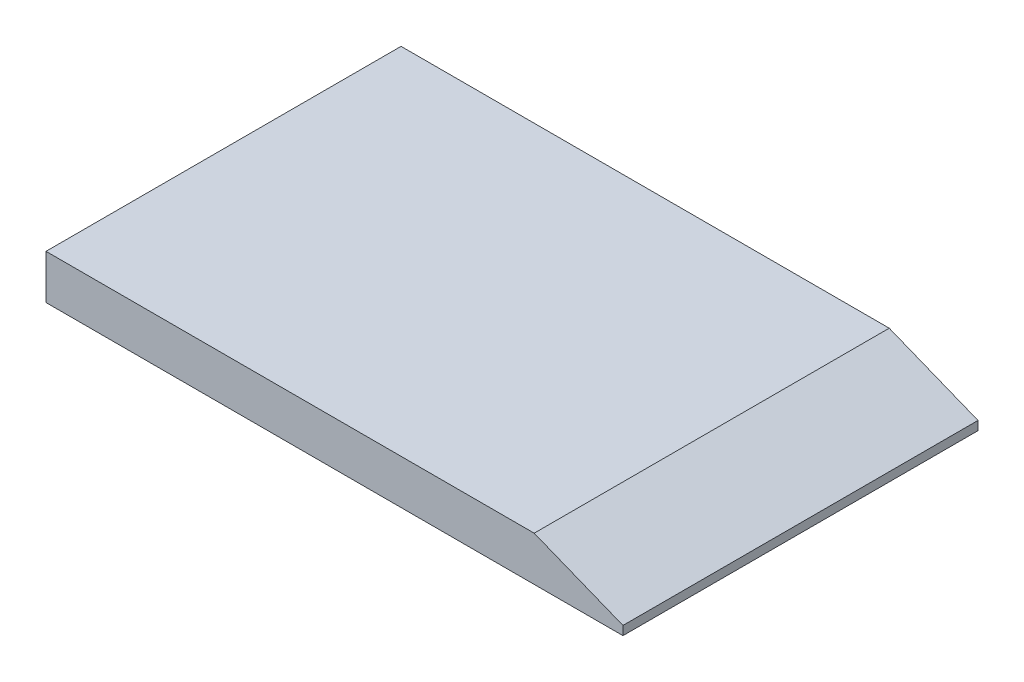
ISO-10303-21;
HEADER;
FILE_DESCRIPTION(('STEP AP214'),'2;1');
FILE_NAME('part.step','',(''),(''),'','','');
FILE_SCHEMA(('AUTOMOTIVE_DESIGN { 1 0 10303 214 1 1 1 1 }'));
ENDSEC;
DATA;
#1=APPLICATION_CONTEXT('core data for automotive mechanical design processes');
#2=APPLICATION_PROTOCOL_DEFINITION('international standard','automotive_design',2000,#1);
#3=PRODUCT_CONTEXT('',#1,'mechanical');
#4=PRODUCT('Part','Part','',(#3));
#5=PRODUCT_RELATED_PRODUCT_CATEGORY('part','',(#4));
#6=PRODUCT_DEFINITION_FORMATION('','',#4);
#7=PRODUCT_DEFINITION_CONTEXT('part definition',#1,'design');
#8=PRODUCT_DEFINITION('design','',#6,#7);
#9=PRODUCT_DEFINITION_SHAPE('','',#8);
#10=(LENGTH_UNIT() NAMED_UNIT(*) SI_UNIT(.MILLI.,.METRE.));
#11=(NAMED_UNIT(*) PLANE_ANGLE_UNIT() SI_UNIT($,.RADIAN.));
#12=(NAMED_UNIT(*) SI_UNIT($,.STERADIAN.) SOLID_ANGLE_UNIT());
#13=UNCERTAINTY_MEASURE_WITH_UNIT(LENGTH_MEASURE(1.E-05),#10,'distance_accuracy_value','');
#14=(GEOMETRIC_REPRESENTATION_CONTEXT(3) GLOBAL_UNCERTAINTY_ASSIGNED_CONTEXT((#13)) GLOBAL_UNIT_ASSIGNED_CONTEXT((#10,
#11,#12)) REPRESENTATION_CONTEXT('',''));
#15=CARTESIAN_POINT('',(0.,0.,0.));
#16=DIRECTION('',(0.,0.,1.));
#17=DIRECTION('',(1.,0.,0.));
#18=AXIS2_PLACEMENT_3D('',#15,#16,#17);
#19=CARTESIAN_POINT('',(65.,10.,40.));
#20=DIRECTION('',(-1.,0.,0.));
#21=DIRECTION('',(0.,0.,1.));
#22=AXIS2_PLACEMENT_3D('',#19,#20,#21);
#23=PLANE('',#22);
#24=DIRECTION('',(0.,-1.,0.));
#25=VECTOR('',#24,1.);
#26=CARTESIAN_POINT('',(65.,10.,-40.));
#27=LINE('',#26,#25);
#28=CARTESIAN_POINT('',(65.,2.,-40.));
#29=VERTEX_POINT('',#28);
#30=CARTESIAN_POINT('',(65.,0.,-40.));
#31=VERTEX_POINT('',#30);
#32=EDGE_CURVE('E11',#29,#31,#27,.T.);
#33=ORIENTED_EDGE('',*,*,#32,.F.);
#34=DIRECTION('',(0.,0.,1.));
#35=VECTOR('',#34,1.);
#36=CARTESIAN_POINT('',(65.,2.,-40.));
#37=LINE('',#36,#35);
#38=CARTESIAN_POINT('',(65.,2.,40.));
#39=VERTEX_POINT('',#38);
#40=EDGE_CURVE('E81',#29,#39,#37,.T.);
#41=ORIENTED_EDGE('',*,*,#40,.T.);
#42=DIRECTION('',(0.,-1.,0.));
#43=VECTOR('',#42,1.);
#44=CARTESIAN_POINT('',(65.,10.,40.));
#45=LINE('',#44,#43);
#46=CARTESIAN_POINT('',(65.,0.,40.));
#47=VERTEX_POINT('',#46);
#48=EDGE_CURVE('E75',#39,#47,#45,.T.);
#49=ORIENTED_EDGE('',*,*,#48,.T.);
#50=DIRECTION('',(0.,0.,-1.));
#51=VECTOR('',#50,1.);
#52=CARTESIAN_POINT('',(65.,0.,40.));
#53=LINE('',#52,#51);
#54=EDGE_CURVE('E79',#47,#31,#53,.T.);
#55=ORIENTED_EDGE('',*,*,#54,.T.);
#56=EDGE_LOOP('',(#33,#41,#49,#55));
#57=FACE_BOUND('',#56,.T.);
#58=ADVANCED_FACE('F33',(#57),#23,.F.);
#59=CARTESIAN_POINT('',(-65.,10.,-40.));
#60=DIRECTION('',(0.,0.,1.));
#61=DIRECTION('',(1.,0.,0.));
#62=AXIS2_PLACEMENT_3D('',#59,#60,#61);
#63=PLANE('',#62);
#64=DIRECTION('',(-1.,0.,0.));
#65=VECTOR('',#64,1.);
#66=CARTESIAN_POINT('',(-65.,10.,-40.));
#67=LINE('',#66,#65);
#68=CARTESIAN_POINT('',(45.,10.,-40.));
#69=VERTEX_POINT('',#68);
#70=CARTESIAN_POINT('',(-65.,10.,-40.));
#71=VERTEX_POINT('',#70);
#72=EDGE_CURVE('E94',#69,#71,#67,.T.);
#73=ORIENTED_EDGE('',*,*,#72,.F.);
#74=DIRECTION('',(0.928476690885259,-0.371390676354104,0.));
#75=VECTOR('',#74,1.);
#76=CARTESIAN_POINT('',(65.,2.,-40.));
#77=LINE('',#76,#75);
#78=EDGE_CURVE('E47',#69,#29,#77,.T.);
#79=ORIENTED_EDGE('',*,*,#78,.T.);
#80=ORIENTED_EDGE('',*,*,#32,.T.);
#81=DIRECTION('',(-1.,0.,0.));
#82=VECTOR('',#81,1.);
#83=CARTESIAN_POINT('',(-65.,0.,-40.));
#84=LINE('',#83,#82);
#85=CARTESIAN_POINT('',(-65.,0.,-40.));
#86=VERTEX_POINT('',#85);
#87=EDGE_CURVE('E99',#31,#86,#84,.T.);
#88=ORIENTED_EDGE('',*,*,#87,.T.);
#89=DIRECTION('',(0.,-1.,0.));
#90=VECTOR('',#89,1.);
#91=CARTESIAN_POINT('',(-65.,10.,-40.));
#92=LINE('',#91,#90);
#93=EDGE_CURVE('E40',#71,#86,#92,.T.);
#94=ORIENTED_EDGE('',*,*,#93,.F.);
#95=EDGE_LOOP('',(#73,#79,#80,#88,#94));
#96=FACE_BOUND('',#95,.T.);
#97=ADVANCED_FACE('F114',(#96),#63,.F.);
#98=CARTESIAN_POINT('',(-65.,10.,40.));
#99=DIRECTION('',(1.,0.,0.));
#100=DIRECTION('',(0.,0.,-1.));
#101=AXIS2_PLACEMENT_3D('',#98,#99,#100);
#102=PLANE('',#101);
#103=DIRECTION('',(0.,0.,1.));
#104=VECTOR('',#103,1.);
#105=CARTESIAN_POINT('',(-65.,0.,40.));
#106=LINE('',#105,#104);
#107=CARTESIAN_POINT('',(-65.,0.,40.));
#108=VERTEX_POINT('',#107);
#109=EDGE_CURVE('E95',#86,#108,#106,.T.);
#110=ORIENTED_EDGE('',*,*,#109,.T.);
#111=DIRECTION('',(0.,-1.,0.));
#112=VECTOR('',#111,1.);
#113=CARTESIAN_POINT('',(-65.,10.,40.));
#114=LINE('',#113,#112);
#115=CARTESIAN_POINT('',(-65.,10.,40.));
#116=VERTEX_POINT('',#115);
#117=EDGE_CURVE('E84',#116,#108,#114,.T.);
#118=ORIENTED_EDGE('',*,*,#117,.F.);
#119=DIRECTION('',(0.,0.,1.));
#120=VECTOR('',#119,1.);
#121=CARTESIAN_POINT('',(-65.,10.,40.));
#122=LINE('',#121,#120);
#123=EDGE_CURVE('E56',#71,#116,#122,.T.);
#124=ORIENTED_EDGE('',*,*,#123,.F.);
#125=ORIENTED_EDGE('',*,*,#93,.T.);
#126=EDGE_LOOP('',(#110,#118,#124,#125));
#127=FACE_BOUND('',#126,.T.);
#128=ADVANCED_FACE('F111',(#127),#102,.F.);
#129=CARTESIAN_POINT('',(-65.,10.,40.));
#130=DIRECTION('',(0.,0.,-1.));
#131=DIRECTION('',(-1.,0.,0.));
#132=AXIS2_PLACEMENT_3D('',#129,#130,#131);
#133=PLANE('',#132);
#134=ORIENTED_EDGE('',*,*,#48,.F.);
#135=DIRECTION('',(0.928476690885259,-0.371390676354104,0.));
#136=VECTOR('',#135,1.);
#137=CARTESIAN_POINT('',(65.,2.,40.));
#138=LINE('',#137,#136);
#139=CARTESIAN_POINT('',(45.,10.,40.));
#140=VERTEX_POINT('',#139);
#141=EDGE_CURVE('E120',#140,#39,#138,.T.);
#142=ORIENTED_EDGE('',*,*,#141,.F.);
#143=DIRECTION('',(1.,0.,0.));
#144=VECTOR('',#143,1.);
#145=CARTESIAN_POINT('',(-65.,10.,40.));
#146=LINE('',#145,#144);
#147=EDGE_CURVE('E85',#116,#140,#146,.T.);
#148=ORIENTED_EDGE('',*,*,#147,.F.);
#149=ORIENTED_EDGE('',*,*,#117,.T.);
#150=DIRECTION('',(1.,0.,0.));
#151=VECTOR('',#150,1.);
#152=CARTESIAN_POINT('',(-65.,0.,40.));
#153=LINE('',#152,#151);
#154=EDGE_CURVE('E89',#108,#47,#153,.T.);
#155=ORIENTED_EDGE('',*,*,#154,.T.);
#156=EDGE_LOOP('',(#134,#142,#148,#149,#155));
#157=FACE_BOUND('',#156,.T.);
#158=ADVANCED_FACE('F90',(#157),#133,.F.);
#159=CARTESIAN_POINT('',(0.,10.,0.));
#160=DIRECTION('',(0.,-1.,0.));
#161=DIRECTION('',(0.,0.,-1.));
#162=AXIS2_PLACEMENT_3D('',#159,#160,#161);
#163=PLANE('',#162);
#164=ORIENTED_EDGE('',*,*,#147,.T.);
#165=DIRECTION('',(0.,0.,1.));
#166=VECTOR('',#165,1.);
#167=CARTESIAN_POINT('',(45.,10.,-40.));
#168=LINE('',#167,#166);
#169=EDGE_CURVE('E102',#69,#140,#168,.T.);
#170=ORIENTED_EDGE('',*,*,#169,.F.);
#171=ORIENTED_EDGE('',*,*,#72,.T.);
#172=ORIENTED_EDGE('',*,*,#123,.T.);
#173=EDGE_LOOP('',(#164,#170,#171,#172));
#174=FACE_BOUND('',#173,.T.);
#175=ADVANCED_FACE('F123',(#174),#163,.F.);
#176=CARTESIAN_POINT('',(0.,0.,0.));
#177=DIRECTION('',(0.,-1.,0.));
#178=DIRECTION('',(0.,0.,-1.));
#179=AXIS2_PLACEMENT_3D('',#176,#177,#178);
#180=PLANE('',#179);
#181=ORIENTED_EDGE('',*,*,#54,.F.);
#182=ORIENTED_EDGE('',*,*,#154,.F.);
#183=ORIENTED_EDGE('',*,*,#109,.F.);
#184=ORIENTED_EDGE('',*,*,#87,.F.);
#185=EDGE_LOOP('',(#181,#182,#183,#184));
#186=FACE_BOUND('',#185,.T.);
#187=ADVANCED_FACE('F98',(#186),#180,.T.);
#188=CARTESIAN_POINT('',(65.,2.,-40.));
#189=DIRECTION('',(-0.371390676354104,-0.928476690885259,0.));
#190=DIRECTION('',(0.928476690885259,-0.371390676354104,0.));
#191=AXIS2_PLACEMENT_3D('',#188,#189,#190);
#192=PLANE('',#191);
#193=ORIENTED_EDGE('',*,*,#141,.T.);
#194=ORIENTED_EDGE('',*,*,#40,.F.);
#195=ORIENTED_EDGE('',*,*,#78,.F.);
#196=ORIENTED_EDGE('',*,*,#169,.T.);
#197=EDGE_LOOP('',(#193,#194,#195,#196));
#198=FACE_BOUND('',#197,.T.);
#199=ADVANCED_FACE('F119',(#198),#192,.F.);
#200=CLOSED_SHELL('',(#58,#97,#128,#158,#175,#187,#199));
#201=MANIFOLD_SOLID_BREP('B2',#200);
#202=ADVANCED_BREP_SHAPE_REPRESENTATION('',(#18,#201),#14);
#203=SHAPE_DEFINITION_REPRESENTATION(#9,#202);
ENDSEC;
END-ISO-10303-21;
